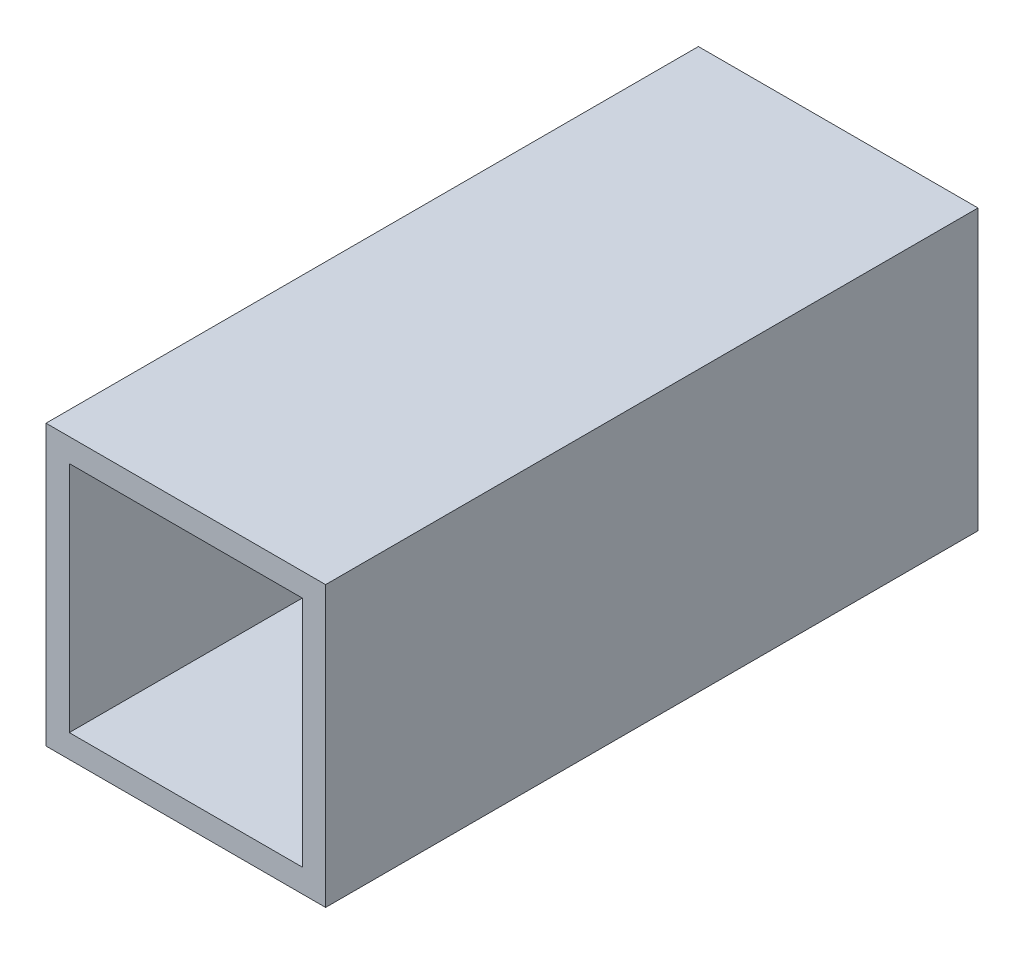
ISO-10303-21;
HEADER;
FILE_DESCRIPTION(('STEP AP214'),'2;1');
FILE_NAME('part.step','',(''),(''),'','','');
FILE_SCHEMA(('AUTOMOTIVE_DESIGN { 1 0 10303 214 1 1 1 1 }'));
ENDSEC;
DATA;
#1=APPLICATION_CONTEXT('core data for automotive mechanical design processes');
#2=APPLICATION_PROTOCOL_DEFINITION('international standard','automotive_design',2000,#1);
#3=PRODUCT_CONTEXT('',#1,'mechanical');
#4=PRODUCT('Part','Part','',(#3));
#5=PRODUCT_RELATED_PRODUCT_CATEGORY('part','',(#4));
#6=PRODUCT_DEFINITION_FORMATION('','',#4);
#7=PRODUCT_DEFINITION_CONTEXT('part definition',#1,'design');
#8=PRODUCT_DEFINITION('design','',#6,#7);
#9=PRODUCT_DEFINITION_SHAPE('','',#8);
#10=(LENGTH_UNIT() NAMED_UNIT(*) SI_UNIT(.MILLI.,.METRE.));
#11=(NAMED_UNIT(*) PLANE_ANGLE_UNIT() SI_UNIT($,.RADIAN.));
#12=(NAMED_UNIT(*) SI_UNIT($,.STERADIAN.) SOLID_ANGLE_UNIT());
#13=UNCERTAINTY_MEASURE_WITH_UNIT(LENGTH_MEASURE(1.E-05),#10,'distance_accuracy_value','');
#14=(GEOMETRIC_REPRESENTATION_CONTEXT(3) GLOBAL_UNCERTAINTY_ASSIGNED_CONTEXT((#13)) GLOBAL_UNIT_ASSIGNED_CONTEXT((#10,
#11,#12)) REPRESENTATION_CONTEXT('',''));
#15=CARTESIAN_POINT('',(0.,0.,0.));
#16=DIRECTION('',(0.,0.,1.));
#17=DIRECTION('',(1.,0.,0.));
#18=AXIS2_PLACEMENT_3D('',#15,#16,#17);
#19=CARTESIAN_POINT('',(0.,0.,22.225));
#20=DIRECTION('',(0.,0.,-1.));
#21=DIRECTION('',(-1.,0.,0.));
#22=AXIS2_PLACEMENT_3D('',#19,#20,#21);
#23=PLANE('',#22);
#24=DIRECTION('',(0.,-1.,0.));
#25=VECTOR('',#24,1.);
#26=CARTESIAN_POINT('',(-9.525,9.525,22.225));
#27=LINE('',#26,#25);
#28=CARTESIAN_POINT('',(-9.525,9.525,22.225));
#29=VERTEX_POINT('',#28);
#30=CARTESIAN_POINT('',(-9.525,-9.525,22.225));
#31=VERTEX_POINT('',#30);
#32=EDGE_CURVE('E157',#29,#31,#27,.T.);
#33=ORIENTED_EDGE('',*,*,#32,.T.);
#34=DIRECTION('',(1.,0.,0.));
#35=VECTOR('',#34,1.);
#36=CARTESIAN_POINT('',(9.52500000000001,-9.525,22.225));
#37=LINE('',#36,#35);
#38=CARTESIAN_POINT('',(9.52500000000001,-9.525,22.225));
#39=VERTEX_POINT('',#38);
#40=EDGE_CURVE('E161',#31,#39,#37,.T.);
#41=ORIENTED_EDGE('',*,*,#40,.T.);
#42=DIRECTION('',(0.,1.,0.));
#43=VECTOR('',#42,1.);
#44=CARTESIAN_POINT('',(9.525,9.52500000000001,22.225));
#45=LINE('',#44,#43);
#46=CARTESIAN_POINT('',(9.525,9.52500000000001,22.225));
#47=VERTEX_POINT('',#46);
#48=EDGE_CURVE('E165',#39,#47,#45,.T.);
#49=ORIENTED_EDGE('',*,*,#48,.T.);
#50=DIRECTION('',(-1.,0.,0.));
#51=VECTOR('',#50,1.);
#52=CARTESIAN_POINT('',(9.525,9.52500000000001,22.225));
#53=LINE('',#52,#51);
#54=EDGE_CURVE('E168',#47,#29,#53,.T.);
#55=ORIENTED_EDGE('',*,*,#54,.T.);
#56=EDGE_LOOP('',(#33,#41,#49,#55));
#57=FACE_BOUND('',#56,.T.);
#58=DIRECTION('',(-1.,0.,0.));
#59=VECTOR('',#58,1.);
#60=CARTESIAN_POINT('',(7.9375,7.93750000000001,22.225));
#61=LINE('',#60,#59);
#62=CARTESIAN_POINT('',(7.9375,7.93750000000001,22.225));
#63=VERTEX_POINT('',#62);
#64=CARTESIAN_POINT('',(-7.9375,7.9375,22.225));
#65=VERTEX_POINT('',#64);
#66=EDGE_CURVE('E109',#63,#65,#61,.T.);
#67=ORIENTED_EDGE('',*,*,#66,.F.);
#68=DIRECTION('',(0.,1.,0.));
#69=VECTOR('',#68,1.);
#70=CARTESIAN_POINT('',(7.9375,7.93750000000001,22.225));
#71=LINE('',#70,#69);
#72=CARTESIAN_POINT('',(7.9375,-7.9375,22.225));
#73=VERTEX_POINT('',#72);
#74=EDGE_CURVE('E135',#73,#63,#71,.T.);
#75=ORIENTED_EDGE('',*,*,#74,.F.);
#76=DIRECTION('',(1.,0.,0.));
#77=VECTOR('',#76,1.);
#78=CARTESIAN_POINT('',(7.9375,-7.9375,22.225));
#79=LINE('',#78,#77);
#80=CARTESIAN_POINT('',(-7.9375,-7.9375,22.225));
#81=VERTEX_POINT('',#80);
#82=EDGE_CURVE('E131',#81,#73,#79,.T.);
#83=ORIENTED_EDGE('',*,*,#82,.F.);
#84=DIRECTION('',(0.,-1.,0.));
#85=VECTOR('',#84,1.);
#86=CARTESIAN_POINT('',(-7.9375,7.9375,22.225));
#87=LINE('',#86,#85);
#88=EDGE_CURVE('E118',#65,#81,#87,.T.);
#89=ORIENTED_EDGE('',*,*,#88,.F.);
#90=EDGE_LOOP('',(#67,#75,#83,#89));
#91=FACE_BOUND('',#90,.T.);
#92=ADVANCED_FACE('F43',(#57,#91),#23,.F.);
#93=CARTESIAN_POINT('',(0.,0.,-22.225));
#94=DIRECTION('',(0.,0.,-1.));
#95=DIRECTION('',(-1.,0.,0.));
#96=AXIS2_PLACEMENT_3D('',#93,#94,#95);
#97=PLANE('',#96);
#98=DIRECTION('',(0.,-1.,0.));
#99=VECTOR('',#98,1.);
#100=CARTESIAN_POINT('',(-9.525,9.525,-22.225));
#101=LINE('',#100,#99);
#102=CARTESIAN_POINT('',(-9.525,9.525,-22.225));
#103=VERTEX_POINT('',#102);
#104=CARTESIAN_POINT('',(-9.525,-9.525,-22.225));
#105=VERTEX_POINT('',#104);
#106=EDGE_CURVE('E127',#103,#105,#101,.T.);
#107=ORIENTED_EDGE('',*,*,#106,.F.);
#108=DIRECTION('',(-1.,0.,0.));
#109=VECTOR('',#108,1.);
#110=CARTESIAN_POINT('',(9.525,9.52500000000001,-22.225));
#111=LINE('',#110,#109);
#112=CARTESIAN_POINT('',(9.525,9.52500000000001,-22.225));
#113=VERTEX_POINT('',#112);
#114=EDGE_CURVE('E162',#113,#103,#111,.T.);
#115=ORIENTED_EDGE('',*,*,#114,.F.);
#116=DIRECTION('',(0.,1.,0.));
#117=VECTOR('',#116,1.);
#118=CARTESIAN_POINT('',(9.525,9.52500000000001,-22.225));
#119=LINE('',#118,#117);
#120=CARTESIAN_POINT('',(9.52500000000001,-9.525,-22.225));
#121=VERTEX_POINT('',#120);
#122=EDGE_CURVE('E178',#121,#113,#119,.T.);
#123=ORIENTED_EDGE('',*,*,#122,.F.);
#124=DIRECTION('',(1.,0.,0.));
#125=VECTOR('',#124,1.);
#126=CARTESIAN_POINT('',(9.52500000000001,-9.525,-22.225));
#127=LINE('',#126,#125);
#128=EDGE_CURVE('E175',#105,#121,#127,.T.);
#129=ORIENTED_EDGE('',*,*,#128,.F.);
#130=EDGE_LOOP('',(#107,#115,#123,#129));
#131=FACE_BOUND('',#130,.T.);
#132=DIRECTION('',(0.,1.,0.));
#133=VECTOR('',#132,1.);
#134=CARTESIAN_POINT('',(7.9375,7.93750000000001,-22.225));
#135=LINE('',#134,#133);
#136=CARTESIAN_POINT('',(7.9375,-7.9375,-22.225));
#137=VERTEX_POINT('',#136);
#138=CARTESIAN_POINT('',(7.9375,7.93750000000001,-22.225));
#139=VERTEX_POINT('',#138);
#140=EDGE_CURVE('E119',#137,#139,#135,.T.);
#141=ORIENTED_EDGE('',*,*,#140,.T.);
#142=DIRECTION('',(-1.,0.,0.));
#143=VECTOR('',#142,1.);
#144=CARTESIAN_POINT('',(7.9375,7.93750000000001,-22.225));
#145=LINE('',#144,#143);
#146=CARTESIAN_POINT('',(-7.9375,7.9375,-22.225));
#147=VERTEX_POINT('',#146);
#148=EDGE_CURVE('E67',#139,#147,#145,.T.);
#149=ORIENTED_EDGE('',*,*,#148,.T.);
#150=DIRECTION('',(0.,-1.,0.));
#151=VECTOR('',#150,1.);
#152=CARTESIAN_POINT('',(-7.9375,7.9375,-22.225));
#153=LINE('',#152,#151);
#154=CARTESIAN_POINT('',(-7.9375,-7.9375,-22.225));
#155=VERTEX_POINT('',#154);
#156=EDGE_CURVE('E125',#147,#155,#153,.T.);
#157=ORIENTED_EDGE('',*,*,#156,.T.);
#158=DIRECTION('',(1.,0.,0.));
#159=VECTOR('',#158,1.);
#160=CARTESIAN_POINT('',(7.9375,-7.9375,-22.225));
#161=LINE('',#160,#159);
#162=EDGE_CURVE('E144',#155,#137,#161,.T.);
#163=ORIENTED_EDGE('',*,*,#162,.T.);
#164=EDGE_LOOP('',(#141,#149,#157,#163));
#165=FACE_BOUND('',#164,.T.);
#166=ADVANCED_FACE('F201',(#131,#165),#97,.T.);
#167=CARTESIAN_POINT('',(-9.525,9.525,22.225));
#168=DIRECTION('',(1.,0.,0.));
#169=DIRECTION('',(0.,1.,0.));
#170=AXIS2_PLACEMENT_3D('',#167,#168,#169);
#171=PLANE('',#170);
#172=ORIENTED_EDGE('',*,*,#106,.T.);
#173=DIRECTION('',(0.,0.,-1.));
#174=VECTOR('',#173,1.);
#175=CARTESIAN_POINT('',(-9.525,-9.525,22.225));
#176=LINE('',#175,#174);
#177=EDGE_CURVE('E11',#31,#105,#176,.T.);
#178=ORIENTED_EDGE('',*,*,#177,.F.);
#179=ORIENTED_EDGE('',*,*,#32,.F.);
#180=DIRECTION('',(0.,0.,-1.));
#181=VECTOR('',#180,1.);
#182=CARTESIAN_POINT('',(-9.525,9.525,22.225));
#183=LINE('',#182,#181);
#184=EDGE_CURVE('E171',#29,#103,#183,.T.);
#185=ORIENTED_EDGE('',*,*,#184,.T.);
#186=EDGE_LOOP('',(#172,#178,#179,#185));
#187=FACE_BOUND('',#186,.T.);
#188=ADVANCED_FACE('F45',(#187),#171,.F.);
#189=CARTESIAN_POINT('',(9.52500000000001,-9.525,22.225));
#190=DIRECTION('',(0.,1.,0.));
#191=DIRECTION('',(-1.,0.,0.));
#192=AXIS2_PLACEMENT_3D('',#189,#190,#191);
#193=PLANE('',#192);
#194=ORIENTED_EDGE('',*,*,#128,.T.);
#195=DIRECTION('',(0.,0.,-1.));
#196=VECTOR('',#195,1.);
#197=CARTESIAN_POINT('',(9.52500000000001,-9.525,22.225));
#198=LINE('',#197,#196);
#199=EDGE_CURVE('E52',#39,#121,#198,.T.);
#200=ORIENTED_EDGE('',*,*,#199,.F.);
#201=ORIENTED_EDGE('',*,*,#40,.F.);
#202=ORIENTED_EDGE('',*,*,#177,.T.);
#203=EDGE_LOOP('',(#194,#200,#201,#202));
#204=FACE_BOUND('',#203,.T.);
#205=ADVANCED_FACE('F211',(#204),#193,.F.);
#206=CARTESIAN_POINT('',(9.525,9.52500000000001,22.225));
#207=DIRECTION('',(-1.,0.,0.));
#208=DIRECTION('',(0.,-1.,0.));
#209=AXIS2_PLACEMENT_3D('',#206,#207,#208);
#210=PLANE('',#209);
#211=ORIENTED_EDGE('',*,*,#122,.T.);
#212=DIRECTION('',(0.,0.,-1.));
#213=VECTOR('',#212,1.);
#214=CARTESIAN_POINT('',(9.525,9.52500000000001,22.225));
#215=LINE('',#214,#213);
#216=EDGE_CURVE('E186',#47,#113,#215,.T.);
#217=ORIENTED_EDGE('',*,*,#216,.F.);
#218=ORIENTED_EDGE('',*,*,#48,.F.);
#219=ORIENTED_EDGE('',*,*,#199,.T.);
#220=EDGE_LOOP('',(#211,#217,#218,#219));
#221=FACE_BOUND('',#220,.T.);
#222=ADVANCED_FACE('F195',(#221),#210,.F.);
#223=CARTESIAN_POINT('',(9.525,9.52500000000001,22.225));
#224=DIRECTION('',(0.,-1.,0.));
#225=DIRECTION('',(1.,0.,0.));
#226=AXIS2_PLACEMENT_3D('',#223,#224,#225);
#227=PLANE('',#226);
#228=ORIENTED_EDGE('',*,*,#114,.T.);
#229=ORIENTED_EDGE('',*,*,#184,.F.);
#230=ORIENTED_EDGE('',*,*,#54,.F.);
#231=ORIENTED_EDGE('',*,*,#216,.T.);
#232=EDGE_LOOP('',(#228,#229,#230,#231));
#233=FACE_BOUND('',#232,.T.);
#234=ADVANCED_FACE('F205',(#233),#227,.F.);
#235=CARTESIAN_POINT('',(7.9375,7.93750000000001,22.225));
#236=DIRECTION('',(0.,-1.,0.));
#237=DIRECTION('',(1.,0.,0.));
#238=AXIS2_PLACEMENT_3D('',#235,#236,#237);
#239=PLANE('',#238);
#240=ORIENTED_EDGE('',*,*,#148,.F.);
#241=DIRECTION('',(0.,0.,-1.));
#242=VECTOR('',#241,1.);
#243=CARTESIAN_POINT('',(7.9375,7.93750000000001,22.225));
#244=LINE('',#243,#242);
#245=EDGE_CURVE('E113',#63,#139,#244,.T.);
#246=ORIENTED_EDGE('',*,*,#245,.F.);
#247=ORIENTED_EDGE('',*,*,#66,.T.);
#248=DIRECTION('',(0.,0.,-1.));
#249=VECTOR('',#248,1.);
#250=CARTESIAN_POINT('',(-7.9375,7.9375,22.225));
#251=LINE('',#250,#249);
#252=EDGE_CURVE('E112',#65,#147,#251,.T.);
#253=ORIENTED_EDGE('',*,*,#252,.T.);
#254=EDGE_LOOP('',(#240,#246,#247,#253));
#255=FACE_BOUND('',#254,.T.);
#256=ADVANCED_FACE('F111',(#255),#239,.T.);
#257=CARTESIAN_POINT('',(-7.9375,7.9375,22.225));
#258=DIRECTION('',(1.,0.,0.));
#259=DIRECTION('',(0.,0.,-1.));
#260=AXIS2_PLACEMENT_3D('',#257,#258,#259);
#261=PLANE('',#260);
#262=ORIENTED_EDGE('',*,*,#156,.F.);
#263=ORIENTED_EDGE('',*,*,#252,.F.);
#264=ORIENTED_EDGE('',*,*,#88,.T.);
#265=DIRECTION('',(0.,0.,-1.));
#266=VECTOR('',#265,1.);
#267=CARTESIAN_POINT('',(-7.9375,-7.9375,22.225));
#268=LINE('',#267,#266);
#269=EDGE_CURVE('E128',#81,#155,#268,.T.);
#270=ORIENTED_EDGE('',*,*,#269,.T.);
#271=EDGE_LOOP('',(#262,#263,#264,#270));
#272=FACE_BOUND('',#271,.T.);
#273=ADVANCED_FACE('F122',(#272),#261,.T.);
#274=CARTESIAN_POINT('',(7.9375,-7.9375,22.225));
#275=DIRECTION('',(0.,1.,0.));
#276=DIRECTION('',(0.,0.,1.));
#277=AXIS2_PLACEMENT_3D('',#274,#275,#276);
#278=PLANE('',#277);
#279=ORIENTED_EDGE('',*,*,#162,.F.);
#280=ORIENTED_EDGE('',*,*,#269,.F.);
#281=ORIENTED_EDGE('',*,*,#82,.T.);
#282=DIRECTION('',(0.,0.,-1.));
#283=VECTOR('',#282,1.);
#284=CARTESIAN_POINT('',(7.9375,-7.9375,22.225));
#285=LINE('',#284,#283);
#286=EDGE_CURVE('E59',#73,#137,#285,.T.);
#287=ORIENTED_EDGE('',*,*,#286,.T.);
#288=EDGE_LOOP('',(#279,#280,#281,#287));
#289=FACE_BOUND('',#288,.T.);
#290=ADVANCED_FACE('F234',(#289),#278,.T.);
#291=CARTESIAN_POINT('',(7.9375,7.93750000000001,22.225));
#292=DIRECTION('',(-1.,0.,0.));
#293=DIRECTION('',(0.,-1.,0.));
#294=AXIS2_PLACEMENT_3D('',#291,#292,#293);
#295=PLANE('',#294);
#296=ORIENTED_EDGE('',*,*,#140,.F.);
#297=ORIENTED_EDGE('',*,*,#286,.F.);
#298=ORIENTED_EDGE('',*,*,#74,.T.);
#299=ORIENTED_EDGE('',*,*,#245,.T.);
#300=EDGE_LOOP('',(#296,#297,#298,#299));
#301=FACE_BOUND('',#300,.T.);
#302=ADVANCED_FACE('F238',(#301),#295,.T.);
#303=CLOSED_SHELL('',(#92,#166,#188,#205,#222,#234,#256,#273,#290,#302));
#304=MANIFOLD_SOLID_BREP('B2',#303);
#305=ADVANCED_BREP_SHAPE_REPRESENTATION('',(#18,#304),#14);
#306=SHAPE_DEFINITION_REPRESENTATION(#9,#305);
ENDSEC;
END-ISO-10303-21;
